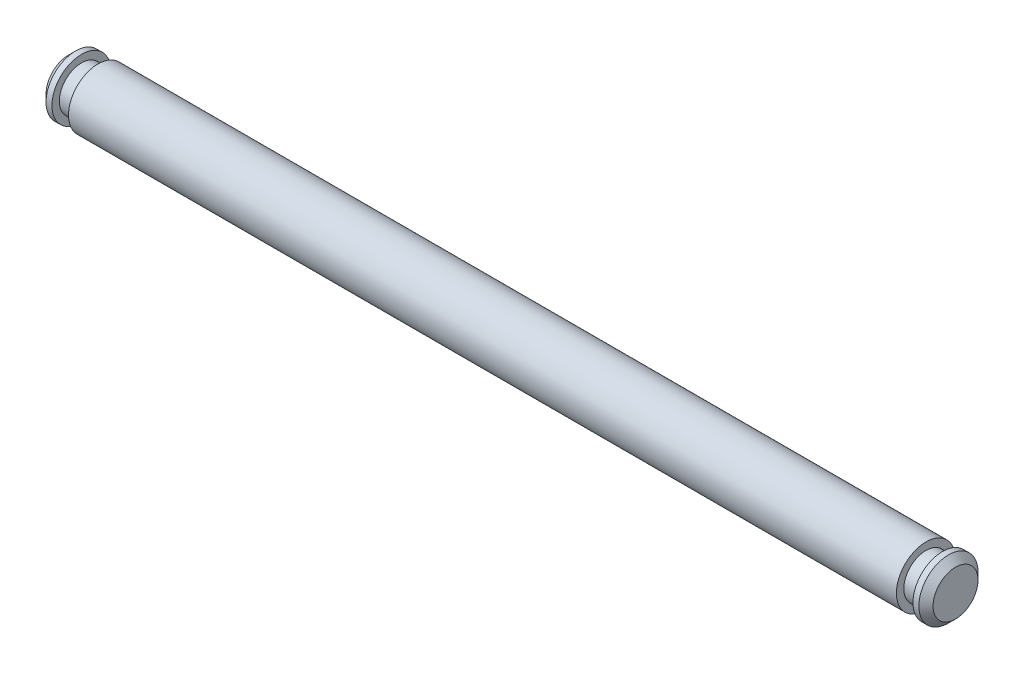
ISO-10303-21;
HEADER;
FILE_DESCRIPTION(('STEP AP214'),'2;1');
FILE_NAME('part.step','',(''),(''),'','','');
FILE_SCHEMA(('AUTOMOTIVE_DESIGN { 1 0 10303 214 1 1 1 1 }'));
ENDSEC;
DATA;
#1=APPLICATION_CONTEXT('core data for automotive mechanical design processes');
#2=APPLICATION_PROTOCOL_DEFINITION('international standard','automotive_design',2000,#1);
#3=PRODUCT_CONTEXT('',#1,'mechanical');
#4=PRODUCT('Part','Part','',(#3));
#5=PRODUCT_RELATED_PRODUCT_CATEGORY('part','',(#4));
#6=PRODUCT_DEFINITION_FORMATION('','',#4);
#7=PRODUCT_DEFINITION_CONTEXT('part definition',#1,'design');
#8=PRODUCT_DEFINITION('design','',#6,#7);
#9=PRODUCT_DEFINITION_SHAPE('','',#8);
#10=(LENGTH_UNIT() NAMED_UNIT(*) SI_UNIT(.MILLI.,.METRE.));
#11=(NAMED_UNIT(*) PLANE_ANGLE_UNIT() SI_UNIT($,.RADIAN.));
#12=(NAMED_UNIT(*) SI_UNIT($,.STERADIAN.) SOLID_ANGLE_UNIT());
#13=UNCERTAINTY_MEASURE_WITH_UNIT(LENGTH_MEASURE(1.E-05),#10,'distance_accuracy_value','');
#14=(GEOMETRIC_REPRESENTATION_CONTEXT(3) GLOBAL_UNCERTAINTY_ASSIGNED_CONTEXT((#13)) GLOBAL_UNIT_ASSIGNED_CONTEXT((#10,
#11,#12)) REPRESENTATION_CONTEXT('',''));
#15=CARTESIAN_POINT('',(0.,0.,0.));
#16=DIRECTION('',(0.,0.,1.));
#17=DIRECTION('',(1.,0.,0.));
#18=AXIS2_PLACEMENT_3D('',#15,#16,#17);
#19=CARTESIAN_POINT('',(0.,2.413,0.));
#20=DIRECTION('',(-1.,0.,0.));
#21=DIRECTION('',(0.,0.,1.));
#22=AXIS2_PLACEMENT_3D('',#19,#20,#21);
#23=PLANE('',#22);
#24=CARTESIAN_POINT('',(0.,0.,0.));
#25=DIRECTION('',(1.,0.,0.));
#26=DIRECTION('',(0.,0.,-1.));
#27=AXIS2_PLACEMENT_3D('',#24,#25,#26);
#28=CIRCLE('',#27,2.413);
#29=CARTESIAN_POINT('',(0.,0.,-2.413));
#30=VERTEX_POINT('',#29);
#31=EDGE_CURVE('E70',#30,#30,#28,.T.);
#32=ORIENTED_EDGE('',*,*,#31,.F.);
#33=EDGE_LOOP('',(#32));
#34=FACE_BOUND('',#33,.T.);
#35=ADVANCED_FACE('F30',(#34),#23,.T.);
#36=CARTESIAN_POINT('',(95.25,0.,0.));
#37=DIRECTION('',(1.,0.,0.));
#38=DIRECTION('',(0.,0.,-1.));
#39=AXIS2_PLACEMENT_3D('',#36,#37,#38);
#40=PLANE('',#39);
#41=CARTESIAN_POINT('',(95.25,0.,0.));
#42=DIRECTION('',(1.,0.,0.));
#43=DIRECTION('',(0.,0.,-1.));
#44=AXIS2_PLACEMENT_3D('',#41,#42,#43);
#45=CIRCLE('',#44,2.413);
#46=CARTESIAN_POINT('',(95.25,0.,-2.413));
#47=VERTEX_POINT('',#46);
#48=EDGE_CURVE('E10',#47,#47,#45,.T.);
#49=ORIENTED_EDGE('',*,*,#48,.T.);
#50=EDGE_LOOP('',(#49));
#51=FACE_BOUND('',#50,.T.);
#52=ADVANCED_FACE('F78',(#51),#40,.T.);
#53=CARTESIAN_POINT('',(95.25,0.,0.));
#54=DIRECTION('',(-1.,0.,0.));
#55=DIRECTION('',(0.,0.,1.));
#56=AXIS2_PLACEMENT_3D('',#53,#54,#55);
#57=CONICAL_SURFACE('',#56,2.413,0.785398163397449);
#58=CARTESIAN_POINT('',(94.488,0.,0.));
#59=DIRECTION('',(1.,0.,0.));
#60=DIRECTION('',(0.,0.,-1.));
#61=AXIS2_PLACEMENT_3D('',#58,#59,#60);
#62=CIRCLE('',#61,3.175);
#63=CARTESIAN_POINT('',(94.488,0.,-3.175));
#64=VERTEX_POINT('',#63);
#65=EDGE_CURVE('E36',#64,#64,#62,.T.);
#66=ORIENTED_EDGE('',*,*,#65,.T.);
#67=EDGE_LOOP('',(#66));
#68=FACE_BOUND('',#67,.T.);
#69=ORIENTED_EDGE('',*,*,#48,.F.);
#70=EDGE_LOOP('',(#69));
#71=FACE_BOUND('',#70,.T.);
#72=ADVANCED_FACE('F82',(#68,#71),#57,.T.);
#73=CARTESIAN_POINT('',(0.,0.,0.));
#74=DIRECTION('',(1.,0.,0.));
#75=DIRECTION('',(0.,0.,-1.));
#76=AXIS2_PLACEMENT_3D('',#73,#74,#75);
#77=CYLINDRICAL_SURFACE('',#76,3.175);
#78=CARTESIAN_POINT('',(93.853,0.,0.));
#79=DIRECTION('',(1.,0.,0.));
#80=DIRECTION('',(0.,0.,-1.));
#81=AXIS2_PLACEMENT_3D('',#78,#79,#80);
#82=CIRCLE('',#81,3.175);
#83=CARTESIAN_POINT('',(93.853,0.,-3.175));
#84=VERTEX_POINT('',#83);
#85=EDGE_CURVE('E40',#84,#84,#82,.T.);
#86=ORIENTED_EDGE('',*,*,#85,.T.);
#87=EDGE_LOOP('',(#86));
#88=FACE_BOUND('',#87,.T.);
#89=ORIENTED_EDGE('',*,*,#65,.F.);
#90=EDGE_LOOP('',(#89));
#91=FACE_BOUND('',#90,.T.);
#92=ADVANCED_FACE('F86',(#88,#91),#77,.T.);
#93=CARTESIAN_POINT('',(93.853,3.175,0.));
#94=DIRECTION('',(-1.,0.,0.));
#95=DIRECTION('',(0.,0.,1.));
#96=AXIS2_PLACEMENT_3D('',#93,#94,#95);
#97=PLANE('',#96);
#98=CARTESIAN_POINT('',(93.853,0.,0.));
#99=DIRECTION('',(1.,0.,0.));
#100=DIRECTION('',(0.,0.,-1.));
#101=AXIS2_PLACEMENT_3D('',#98,#99,#100);
#102=CIRCLE('',#101,2.38125);
#103=CARTESIAN_POINT('',(93.853,0.,-2.38125));
#104=VERTEX_POINT('',#103);
#105=EDGE_CURVE('E44',#104,#104,#102,.T.);
#106=ORIENTED_EDGE('',*,*,#105,.T.);
#107=EDGE_LOOP('',(#106));
#108=FACE_BOUND('',#107,.T.);
#109=ORIENTED_EDGE('',*,*,#85,.F.);
#110=EDGE_LOOP('',(#109));
#111=FACE_BOUND('',#110,.T.);
#112=ADVANCED_FACE('F91',(#108,#111),#97,.T.);
#113=CARTESIAN_POINT('',(0.,0.,0.));
#114=DIRECTION('',(1.,0.,0.));
#115=DIRECTION('',(0.,0.,-1.));
#116=AXIS2_PLACEMENT_3D('',#113,#114,#115);
#117=CYLINDRICAL_SURFACE('',#116,2.38125);
#118=CARTESIAN_POINT('',(92.075,0.,0.));
#119=DIRECTION('',(1.,0.,0.));
#120=DIRECTION('',(0.,0.,-1.));
#121=AXIS2_PLACEMENT_3D('',#118,#119,#120);
#122=CIRCLE('',#121,2.38125);
#123=CARTESIAN_POINT('',(92.075,0.,-2.38125));
#124=VERTEX_POINT('',#123);
#125=EDGE_CURVE('E49',#124,#124,#122,.T.);
#126=ORIENTED_EDGE('',*,*,#125,.T.);
#127=EDGE_LOOP('',(#126));
#128=FACE_BOUND('',#127,.T.);
#129=ORIENTED_EDGE('',*,*,#105,.F.);
#130=EDGE_LOOP('',(#129));
#131=FACE_BOUND('',#130,.T.);
#132=ADVANCED_FACE('F95',(#128,#131),#117,.T.);
#133=CARTESIAN_POINT('',(92.075,2.38125,0.));
#134=DIRECTION('',(1.,0.,0.));
#135=DIRECTION('',(0.,0.,-1.));
#136=AXIS2_PLACEMENT_3D('',#133,#134,#135);
#137=PLANE('',#136);
#138=CARTESIAN_POINT('',(92.075,0.,0.));
#139=DIRECTION('',(1.,0.,0.));
#140=DIRECTION('',(0.,0.,-1.));
#141=AXIS2_PLACEMENT_3D('',#138,#139,#140);
#142=CIRCLE('',#141,3.175);
#143=CARTESIAN_POINT('',(92.075,0.,-3.175));
#144=VERTEX_POINT('',#143);
#145=EDGE_CURVE('E52',#144,#144,#142,.T.);
#146=ORIENTED_EDGE('',*,*,#145,.T.);
#147=EDGE_LOOP('',(#146));
#148=FACE_BOUND('',#147,.T.);
#149=ORIENTED_EDGE('',*,*,#125,.F.);
#150=EDGE_LOOP('',(#149));
#151=FACE_BOUND('',#150,.T.);
#152=ADVANCED_FACE('F99',(#148,#151),#137,.T.);
#153=CARTESIAN_POINT('',(0.,0.,0.));
#154=DIRECTION('',(1.,0.,0.));
#155=DIRECTION('',(0.,0.,-1.));
#156=AXIS2_PLACEMENT_3D('',#153,#154,#155);
#157=CYLINDRICAL_SURFACE('',#156,3.175);
#158=CARTESIAN_POINT('',(3.175,0.,0.));
#159=DIRECTION('',(1.,0.,0.));
#160=DIRECTION('',(0.,0.,-1.));
#161=AXIS2_PLACEMENT_3D('',#158,#159,#160);
#162=CIRCLE('',#161,3.175);
#163=CARTESIAN_POINT('',(3.175,0.,-3.175));
#164=VERTEX_POINT('',#163);
#165=EDGE_CURVE('E55',#164,#164,#162,.T.);
#166=ORIENTED_EDGE('',*,*,#165,.T.);
#167=EDGE_LOOP('',(#166));
#168=FACE_BOUND('',#167,.T.);
#169=ORIENTED_EDGE('',*,*,#145,.F.);
#170=EDGE_LOOP('',(#169));
#171=FACE_BOUND('',#170,.T.);
#172=ADVANCED_FACE('F103',(#168,#171),#157,.T.);
#173=CARTESIAN_POINT('',(3.175,3.175,0.));
#174=DIRECTION('',(-1.,0.,0.));
#175=DIRECTION('',(0.,0.,1.));
#176=AXIS2_PLACEMENT_3D('',#173,#174,#175);
#177=PLANE('',#176);
#178=CARTESIAN_POINT('',(3.175,0.,0.));
#179=DIRECTION('',(1.,0.,0.));
#180=DIRECTION('',(0.,0.,-1.));
#181=AXIS2_PLACEMENT_3D('',#178,#179,#180);
#182=CIRCLE('',#181,2.38125);
#183=CARTESIAN_POINT('',(3.175,0.,-2.38125));
#184=VERTEX_POINT('',#183);
#185=EDGE_CURVE('E58',#184,#184,#182,.T.);
#186=ORIENTED_EDGE('',*,*,#185,.T.);
#187=EDGE_LOOP('',(#186));
#188=FACE_BOUND('',#187,.T.);
#189=ORIENTED_EDGE('',*,*,#165,.F.);
#190=EDGE_LOOP('',(#189));
#191=FACE_BOUND('',#190,.T.);
#192=ADVANCED_FACE('F107',(#188,#191),#177,.T.);
#193=CARTESIAN_POINT('',(0.,0.,0.));
#194=DIRECTION('',(1.,0.,0.));
#195=DIRECTION('',(0.,0.,-1.));
#196=AXIS2_PLACEMENT_3D('',#193,#194,#195);
#197=CYLINDRICAL_SURFACE('',#196,2.38125);
#198=CARTESIAN_POINT('',(1.397,0.,0.));
#199=DIRECTION('',(1.,0.,0.));
#200=DIRECTION('',(0.,0.,-1.));
#201=AXIS2_PLACEMENT_3D('',#198,#199,#200);
#202=CIRCLE('',#201,2.38125);
#203=CARTESIAN_POINT('',(1.397,0.,-2.38125));
#204=VERTEX_POINT('',#203);
#205=EDGE_CURVE('E61',#204,#204,#202,.T.);
#206=ORIENTED_EDGE('',*,*,#205,.T.);
#207=EDGE_LOOP('',(#206));
#208=FACE_BOUND('',#207,.T.);
#209=ORIENTED_EDGE('',*,*,#185,.F.);
#210=EDGE_LOOP('',(#209));
#211=FACE_BOUND('',#210,.T.);
#212=ADVANCED_FACE('F111',(#208,#211),#197,.T.);
#213=CARTESIAN_POINT('',(1.397,2.38125,0.));
#214=DIRECTION('',(1.,0.,0.));
#215=DIRECTION('',(0.,0.,-1.));
#216=AXIS2_PLACEMENT_3D('',#213,#214,#215);
#217=PLANE('',#216);
#218=CARTESIAN_POINT('',(1.397,0.,0.));
#219=DIRECTION('',(1.,0.,0.));
#220=DIRECTION('',(0.,0.,-1.));
#221=AXIS2_PLACEMENT_3D('',#218,#219,#220);
#222=CIRCLE('',#221,3.175);
#223=CARTESIAN_POINT('',(1.397,0.,-3.175));
#224=VERTEX_POINT('',#223);
#225=EDGE_CURVE('E64',#224,#224,#222,.T.);
#226=ORIENTED_EDGE('',*,*,#225,.T.);
#227=EDGE_LOOP('',(#226));
#228=FACE_BOUND('',#227,.T.);
#229=ORIENTED_EDGE('',*,*,#205,.F.);
#230=EDGE_LOOP('',(#229));
#231=FACE_BOUND('',#230,.T.);
#232=ADVANCED_FACE('F115',(#228,#231),#217,.T.);
#233=CARTESIAN_POINT('',(0.,0.,0.));
#234=DIRECTION('',(1.,0.,0.));
#235=DIRECTION('',(0.,0.,-1.));
#236=AXIS2_PLACEMENT_3D('',#233,#234,#235);
#237=CYLINDRICAL_SURFACE('',#236,3.175);
#238=CARTESIAN_POINT('',(0.762,0.,0.));
#239=DIRECTION('',(1.,0.,0.));
#240=DIRECTION('',(0.,0.,-1.));
#241=AXIS2_PLACEMENT_3D('',#238,#239,#240);
#242=CIRCLE('',#241,3.175);
#243=CARTESIAN_POINT('',(0.762,0.,-3.175));
#244=VERTEX_POINT('',#243);
#245=EDGE_CURVE('E67',#244,#244,#242,.T.);
#246=ORIENTED_EDGE('',*,*,#245,.T.);
#247=EDGE_LOOP('',(#246));
#248=FACE_BOUND('',#247,.T.);
#249=ORIENTED_EDGE('',*,*,#225,.F.);
#250=EDGE_LOOP('',(#249));
#251=FACE_BOUND('',#250,.T.);
#252=ADVANCED_FACE('F119',(#248,#251),#237,.T.);
#253=CARTESIAN_POINT('',(0.762,0.,0.));
#254=DIRECTION('',(1.,0.,0.));
#255=DIRECTION('',(0.,0.,-1.));
#256=AXIS2_PLACEMENT_3D('',#253,#254,#255);
#257=CONICAL_SURFACE('',#256,3.175,0.785398163397448);
#258=ORIENTED_EDGE('',*,*,#31,.T.);
#259=EDGE_LOOP('',(#258));
#260=FACE_BOUND('',#259,.T.);
#261=ORIENTED_EDGE('',*,*,#245,.F.);
#262=EDGE_LOOP('',(#261));
#263=FACE_BOUND('',#262,.T.);
#264=ADVANCED_FACE('F74',(#260,#263),#257,.T.);
#265=CLOSED_SHELL('',(#35,#52,#72,#92,#112,#132,#152,#172,#192,#212,#232,#252,#264));
#266=MANIFOLD_SOLID_BREP('B2',#265);
#267=ADVANCED_BREP_SHAPE_REPRESENTATION('',(#18,#266),#14);
#268=SHAPE_DEFINITION_REPRESENTATION(#9,#267);
ENDSEC;
END-ISO-10303-21;
